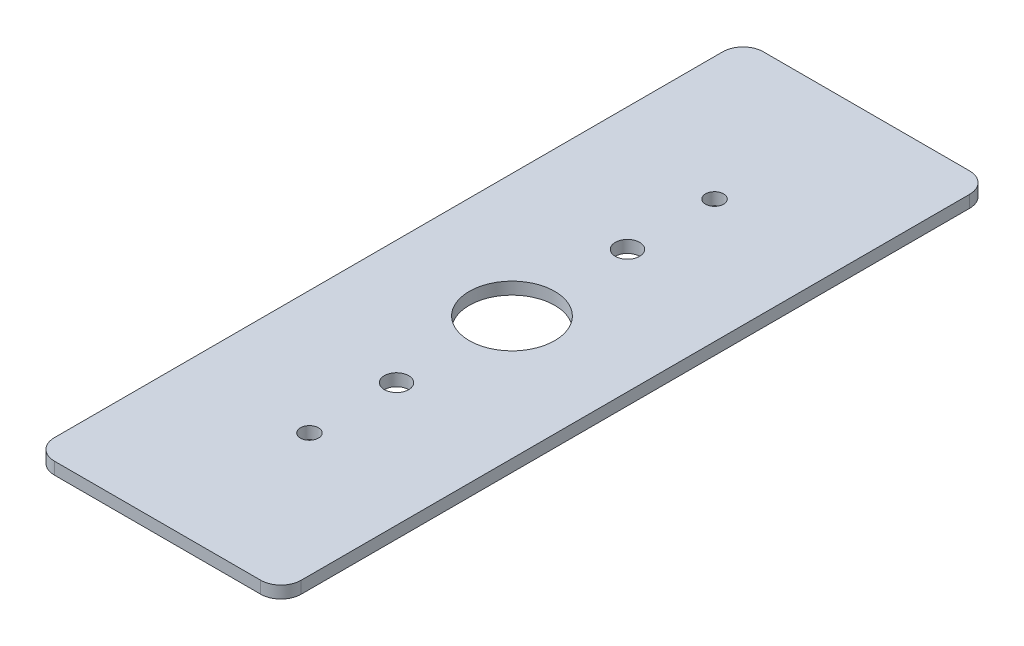
ISO-10303-21;
HEADER;
FILE_DESCRIPTION(('STEP AP214'),'2;1');
FILE_NAME('part.step','',(''),(''),'','','');
FILE_SCHEMA(('AUTOMOTIVE_DESIGN { 1 0 10303 214 1 1 1 1 }'));
ENDSEC;
DATA;
#1=APPLICATION_CONTEXT('core data for automotive mechanical design processes');
#2=APPLICATION_PROTOCOL_DEFINITION('international standard','automotive_design',2000,#1);
#3=PRODUCT_CONTEXT('',#1,'mechanical');
#4=PRODUCT('Part','Part','',(#3));
#5=PRODUCT_RELATED_PRODUCT_CATEGORY('part','',(#4));
#6=PRODUCT_DEFINITION_FORMATION('','',#4);
#7=PRODUCT_DEFINITION_CONTEXT('part definition',#1,'design');
#8=PRODUCT_DEFINITION('design','',#6,#7);
#9=PRODUCT_DEFINITION_SHAPE('','',#8);
#10=(LENGTH_UNIT() NAMED_UNIT(*) SI_UNIT(.MILLI.,.METRE.));
#11=(NAMED_UNIT(*) PLANE_ANGLE_UNIT() SI_UNIT($,.RADIAN.));
#12=(NAMED_UNIT(*) SI_UNIT($,.STERADIAN.) SOLID_ANGLE_UNIT());
#13=UNCERTAINTY_MEASURE_WITH_UNIT(LENGTH_MEASURE(1.E-05),#10,'distance_accuracy_value','');
#14=(GEOMETRIC_REPRESENTATION_CONTEXT(3) GLOBAL_UNCERTAINTY_ASSIGNED_CONTEXT((#13)) GLOBAL_UNIT_ASSIGNED_CONTEXT((#10,
#11,#12)) REPRESENTATION_CONTEXT('',''));
#15=CARTESIAN_POINT('',(0.,0.,0.));
#16=DIRECTION('',(0.,0.,1.));
#17=DIRECTION('',(1.,0.,0.));
#18=AXIS2_PLACEMENT_3D('',#15,#16,#17);
#19=CARTESIAN_POINT('',(-15.478125,1.524,-44.45));
#20=DIRECTION('',(0.,0.,1.));
#21=DIRECTION('',(1.,0.,0.));
#22=AXIS2_PLACEMENT_3D('',#19,#20,#21);
#23=PLANE('',#22);
#24=DIRECTION('',(-1.,0.,0.));
#25=VECTOR('',#24,1.);
#26=CARTESIAN_POINT('',(-15.478125,1.524,-44.45));
#27=LINE('',#26,#25);
#28=CARTESIAN_POINT('',(12.938125,1.524,-44.45));
#29=VERTEX_POINT('',#28);
#30=CARTESIAN_POINT('',(-12.938125,1.524,-44.45));
#31=VERTEX_POINT('',#30);
#32=EDGE_CURVE('E118',#29,#31,#27,.T.);
#33=ORIENTED_EDGE('',*,*,#32,.F.);
#34=DIRECTION('',(0.,-1.,0.));
#35=VECTOR('',#34,1.);
#36=CARTESIAN_POINT('',(12.938125,1.524,-44.45));
#37=LINE('',#36,#35);
#38=CARTESIAN_POINT('',(12.938125,0.,-44.45));
#39=VERTEX_POINT('',#38);
#40=EDGE_CURVE('E103',#29,#39,#37,.T.);
#41=ORIENTED_EDGE('',*,*,#40,.T.);
#42=DIRECTION('',(-1.,0.,0.));
#43=VECTOR('',#42,1.);
#44=CARTESIAN_POINT('',(-15.478125,0.,-44.45));
#45=LINE('',#44,#43);
#46=CARTESIAN_POINT('',(-12.938125,0.,-44.45));
#47=VERTEX_POINT('',#46);
#48=EDGE_CURVE('E115',#39,#47,#45,.T.);
#49=ORIENTED_EDGE('',*,*,#48,.T.);
#50=DIRECTION('',(0.,-1.,0.));
#51=VECTOR('',#50,1.);
#52=CARTESIAN_POINT('',(-12.938125,1.524,-44.45));
#53=LINE('',#52,#51);
#54=EDGE_CURVE('E120',#47,#31,#53,.F.);
#55=ORIENTED_EDGE('',*,*,#54,.T.);
#56=EDGE_LOOP('',(#33,#41,#49,#55));
#57=FACE_BOUND('',#56,.T.);
#58=ADVANCED_FACE('F34',(#57),#23,.F.);
#59=CARTESIAN_POINT('',(-15.478125,1.524,44.45));
#60=DIRECTION('',(1.,0.,0.));
#61=DIRECTION('',(0.,0.,-1.));
#62=AXIS2_PLACEMENT_3D('',#59,#60,#61);
#63=PLANE('',#62);
#64=DIRECTION('',(0.,0.,1.));
#65=VECTOR('',#64,1.);
#66=CARTESIAN_POINT('',(-15.478125,1.524,44.45));
#67=LINE('',#66,#65);
#68=CARTESIAN_POINT('',(-15.478125,1.524,-41.91));
#69=VERTEX_POINT('',#68);
#70=CARTESIAN_POINT('',(-15.478125,1.524,41.91));
#71=VERTEX_POINT('',#70);
#72=EDGE_CURVE('E173',#69,#71,#67,.T.);
#73=ORIENTED_EDGE('',*,*,#72,.F.);
#74=DIRECTION('',(0.,-1.,0.));
#75=VECTOR('',#74,1.);
#76=CARTESIAN_POINT('',(-15.478125,1.524,-41.91));
#77=LINE('',#76,#75);
#78=CARTESIAN_POINT('',(-15.478125,0.,-41.91));
#79=VERTEX_POINT('',#78);
#80=EDGE_CURVE('E157',#69,#79,#77,.T.);
#81=ORIENTED_EDGE('',*,*,#80,.T.);
#82=DIRECTION('',(0.,0.,1.));
#83=VECTOR('',#82,1.);
#84=CARTESIAN_POINT('',(-15.478125,0.,44.45));
#85=LINE('',#84,#83);
#86=CARTESIAN_POINT('',(-15.478125,0.,41.91));
#87=VERTEX_POINT('',#86);
#88=EDGE_CURVE('E124',#79,#87,#85,.T.);
#89=ORIENTED_EDGE('',*,*,#88,.T.);
#90=DIRECTION('',(0.,-1.,0.));
#91=VECTOR('',#90,1.);
#92=CARTESIAN_POINT('',(-15.478125,1.524,41.91));
#93=LINE('',#92,#91);
#94=EDGE_CURVE('E155',#87,#71,#93,.F.);
#95=ORIENTED_EDGE('',*,*,#94,.T.);
#96=EDGE_LOOP('',(#73,#81,#89,#95));
#97=FACE_BOUND('',#96,.T.);
#98=ADVANCED_FACE('F238',(#97),#63,.F.);
#99=CARTESIAN_POINT('',(-15.478125,1.524,44.45));
#100=DIRECTION('',(0.,0.,-1.));
#101=DIRECTION('',(-1.,0.,0.));
#102=AXIS2_PLACEMENT_3D('',#99,#100,#101);
#103=PLANE('',#102);
#104=DIRECTION('',(1.,0.,0.));
#105=VECTOR('',#104,1.);
#106=CARTESIAN_POINT('',(-15.478125,0.,44.45));
#107=LINE('',#106,#105);
#108=CARTESIAN_POINT('',(-12.938125,0.,44.45));
#109=VERTEX_POINT('',#108);
#110=CARTESIAN_POINT('',(12.938125,0.,44.45));
#111=VERTEX_POINT('',#110);
#112=EDGE_CURVE('E128',#109,#111,#107,.T.);
#113=ORIENTED_EDGE('',*,*,#112,.T.);
#114=DIRECTION('',(0.,-1.,0.));
#115=VECTOR('',#114,1.);
#116=CARTESIAN_POINT('',(12.938125,1.524,44.45));
#117=LINE('',#116,#115);
#118=CARTESIAN_POINT('',(12.938125,1.524,44.45));
#119=VERTEX_POINT('',#118);
#120=EDGE_CURVE('E11',#111,#119,#117,.F.);
#121=ORIENTED_EDGE('',*,*,#120,.T.);
#122=DIRECTION('',(1.,0.,0.));
#123=VECTOR('',#122,1.);
#124=CARTESIAN_POINT('',(-15.478125,1.524,44.45));
#125=LINE('',#124,#123);
#126=CARTESIAN_POINT('',(-12.938125,1.524,44.45));
#127=VERTEX_POINT('',#126);
#128=EDGE_CURVE('E163',#127,#119,#125,.T.);
#129=ORIENTED_EDGE('',*,*,#128,.F.);
#130=DIRECTION('',(0.,-1.,0.));
#131=VECTOR('',#130,1.);
#132=CARTESIAN_POINT('',(-12.938125,1.524,44.45));
#133=LINE('',#132,#131);
#134=EDGE_CURVE('E42',#127,#109,#133,.T.);
#135=ORIENTED_EDGE('',*,*,#134,.T.);
#136=EDGE_LOOP('',(#113,#121,#129,#135));
#137=FACE_BOUND('',#136,.T.);
#138=ADVANCED_FACE('F162',(#137),#103,.F.);
#139=CARTESIAN_POINT('',(15.478125,1.524,-44.45));
#140=DIRECTION('',(-1.,0.,0.));
#141=DIRECTION('',(0.,0.,1.));
#142=AXIS2_PLACEMENT_3D('',#139,#140,#141);
#143=PLANE('',#142);
#144=DIRECTION('',(0.,0.,-1.));
#145=VECTOR('',#144,1.);
#146=CARTESIAN_POINT('',(15.478125,0.,-44.45));
#147=LINE('',#146,#145);
#148=CARTESIAN_POINT('',(15.478125,0.,41.91));
#149=VERTEX_POINT('',#148);
#150=CARTESIAN_POINT('',(15.478125,0.,-41.91));
#151=VERTEX_POINT('',#150);
#152=EDGE_CURVE('E138',#149,#151,#147,.T.);
#153=ORIENTED_EDGE('',*,*,#152,.T.);
#154=DIRECTION('',(0.,-1.,0.));
#155=VECTOR('',#154,1.);
#156=CARTESIAN_POINT('',(15.478125,1.524,-41.91));
#157=LINE('',#156,#155);
#158=CARTESIAN_POINT('',(15.478125,1.524,-41.91));
#159=VERTEX_POINT('',#158);
#160=EDGE_CURVE('E104',#151,#159,#157,.F.);
#161=ORIENTED_EDGE('',*,*,#160,.T.);
#162=DIRECTION('',(0.,0.,-1.));
#163=VECTOR('',#162,1.);
#164=CARTESIAN_POINT('',(15.478125,1.524,-44.45));
#165=LINE('',#164,#163);
#166=CARTESIAN_POINT('',(15.478125,1.524,41.91));
#167=VERTEX_POINT('',#166);
#168=EDGE_CURVE('E134',#167,#159,#165,.T.);
#169=ORIENTED_EDGE('',*,*,#168,.F.);
#170=DIRECTION('',(0.,-1.,0.));
#171=VECTOR('',#170,1.);
#172=CARTESIAN_POINT('',(15.478125,1.524,41.91));
#173=LINE('',#172,#171);
#174=EDGE_CURVE('E109',#167,#149,#173,.T.);
#175=ORIENTED_EDGE('',*,*,#174,.T.);
#176=EDGE_LOOP('',(#153,#161,#169,#175));
#177=FACE_BOUND('',#176,.T.);
#178=ADVANCED_FACE('F171',(#177),#143,.F.);
#179=CARTESIAN_POINT('',(15.478125,1.524,-44.45));
#180=DIRECTION('',(0.,-1.,0.));
#181=DIRECTION('',(0.,0.,-1.));
#182=AXIS2_PLACEMENT_3D('',#179,#180,#181);
#183=PLANE('',#182);
#184=CARTESIAN_POINT('',(0.,1.524,0.));
#185=DIRECTION('',(0.,1.,0.));
#186=DIRECTION('',(0.,0.,1.));
#187=AXIS2_PLACEMENT_3D('',#184,#185,#186);
#188=CIRCLE('',#187,5.35812999999999);
#189=CARTESIAN_POINT('',(0.,1.524,5.35812999999999));
#190=VERTEX_POINT('',#189);
#191=EDGE_CURVE('E200',#190,#190,#188,.T.);
#192=ORIENTED_EDGE('',*,*,#191,.F.);
#193=EDGE_LOOP('',(#192));
#194=FACE_BOUND('',#193,.T.);
#195=CARTESIAN_POINT('',(0.,1.524,25.4));
#196=DIRECTION('',(0.,1.,0.));
#197=DIRECTION('',(0.,0.,1.));
#198=AXIS2_PLACEMENT_3D('',#195,#196,#197);
#199=CIRCLE('',#198,1.1303);
#200=CARTESIAN_POINT('',(0.,1.524,26.5303));
#201=VERTEX_POINT('',#200);
#202=EDGE_CURVE('E194',#201,#201,#199,.T.);
#203=ORIENTED_EDGE('',*,*,#202,.F.);
#204=EDGE_LOOP('',(#203));
#205=FACE_BOUND('',#204,.T.);
#206=CARTESIAN_POINT('',(0.,1.524,-25.4));
#207=DIRECTION('',(0.,1.,0.));
#208=DIRECTION('',(0.,0.,1.));
#209=AXIS2_PLACEMENT_3D('',#206,#207,#208);
#210=CIRCLE('',#209,1.1303);
#211=CARTESIAN_POINT('',(0.,1.524,-24.2697));
#212=VERTEX_POINT('',#211);
#213=EDGE_CURVE('E188',#212,#212,#210,.T.);
#214=ORIENTED_EDGE('',*,*,#213,.F.);
#215=EDGE_LOOP('',(#214));
#216=FACE_BOUND('',#215,.T.);
#217=CARTESIAN_POINT('',(0.,1.524,-14.478));
#218=DIRECTION('',(0.,-1.,0.));
#219=DIRECTION('',(0.,0.,1.));
#220=AXIS2_PLACEMENT_3D('',#217,#218,#219);
#221=CIRCLE('',#220,1.524);
#222=CARTESIAN_POINT('',(0.,1.524,-12.954));
#223=VERTEX_POINT('',#222);
#224=EDGE_CURVE('E178',#223,#223,#221,.T.);
#225=ORIENTED_EDGE('',*,*,#224,.T.);
#226=EDGE_LOOP('',(#225));
#227=FACE_BOUND('',#226,.T.);
#228=CARTESIAN_POINT('',(0.,1.524,14.478));
#229=DIRECTION('',(0.,-1.,0.));
#230=DIRECTION('',(0.,0.,-1.));
#231=AXIS2_PLACEMENT_3D('',#228,#229,#230);
#232=CIRCLE('',#231,1.524);
#233=CARTESIAN_POINT('',(0.,1.524,12.954));
#234=VERTEX_POINT('',#233);
#235=EDGE_CURVE('E125',#234,#234,#232,.T.);
#236=ORIENTED_EDGE('',*,*,#235,.T.);
#237=EDGE_LOOP('',(#236));
#238=FACE_BOUND('',#237,.T.);
#239=ORIENTED_EDGE('',*,*,#168,.T.);
#240=CARTESIAN_POINT('',(12.938125,1.524,-41.91));
#241=DIRECTION('',(0.,-1.,0.));
#242=DIRECTION('',(0.,0.,-1.));
#243=AXIS2_PLACEMENT_3D('',#240,#241,#242);
#244=CIRCLE('',#243,2.54);
#245=EDGE_CURVE('E153',#159,#29,#244,.F.);
#246=ORIENTED_EDGE('',*,*,#245,.T.);
#247=ORIENTED_EDGE('',*,*,#32,.T.);
#248=CARTESIAN_POINT('',(-12.938125,1.524,-41.91));
#249=DIRECTION('',(0.,-1.,0.));
#250=DIRECTION('',(0.,0.,-1.));
#251=AXIS2_PLACEMENT_3D('',#248,#249,#250);
#252=CIRCLE('',#251,2.54);
#253=EDGE_CURVE('E151',#31,#69,#252,.F.);
#254=ORIENTED_EDGE('',*,*,#253,.T.);
#255=ORIENTED_EDGE('',*,*,#72,.T.);
#256=CARTESIAN_POINT('',(-12.938125,1.524,41.91));
#257=DIRECTION('',(0.,-1.,0.));
#258=DIRECTION('',(0.,0.,-1.));
#259=AXIS2_PLACEMENT_3D('',#256,#257,#258);
#260=CIRCLE('',#259,2.54);
#261=EDGE_CURVE('E54',#71,#127,#260,.F.);
#262=ORIENTED_EDGE('',*,*,#261,.T.);
#263=ORIENTED_EDGE('',*,*,#128,.T.);
#264=CARTESIAN_POINT('',(12.938125,1.524,41.91));
#265=DIRECTION('',(0.,-1.,0.));
#266=DIRECTION('',(0.,0.,-1.));
#267=AXIS2_PLACEMENT_3D('',#264,#265,#266);
#268=CIRCLE('',#267,2.54);
#269=EDGE_CURVE('E149',#119,#167,#268,.F.);
#270=ORIENTED_EDGE('',*,*,#269,.T.);
#271=EDGE_LOOP('',(#239,#246,#247,#254,#255,#262,#263,#270));
#272=FACE_BOUND('',#271,.T.);
#273=ADVANCED_FACE('F206',(#194,#205,#216,#227,#238,#272),#183,.F.);
#274=CARTESIAN_POINT('',(15.478125,0.,-44.45));
#275=DIRECTION('',(0.,-1.,0.));
#276=DIRECTION('',(0.,0.,-1.));
#277=AXIS2_PLACEMENT_3D('',#274,#275,#276);
#278=PLANE('',#277);
#279=CARTESIAN_POINT('',(0.,0.,0.));
#280=DIRECTION('',(0.,1.,0.));
#281=DIRECTION('',(0.,0.,1.));
#282=AXIS2_PLACEMENT_3D('',#279,#280,#281);
#283=CIRCLE('',#282,5.35813);
#284=CARTESIAN_POINT('',(0.,0.,5.35813));
#285=VERTEX_POINT('',#284);
#286=EDGE_CURVE('E197',#285,#285,#283,.T.);
#287=ORIENTED_EDGE('',*,*,#286,.T.);
#288=EDGE_LOOP('',(#287));
#289=FACE_BOUND('',#288,.T.);
#290=CARTESIAN_POINT('',(0.,0.,25.4));
#291=DIRECTION('',(0.,1.,0.));
#292=DIRECTION('',(0.,0.,1.));
#293=AXIS2_PLACEMENT_3D('',#290,#291,#292);
#294=CIRCLE('',#293,1.1303);
#295=CARTESIAN_POINT('',(0.,0.,26.5303));
#296=VERTEX_POINT('',#295);
#297=EDGE_CURVE('E191',#296,#296,#294,.T.);
#298=ORIENTED_EDGE('',*,*,#297,.T.);
#299=EDGE_LOOP('',(#298));
#300=FACE_BOUND('',#299,.T.);
#301=CARTESIAN_POINT('',(0.,0.,-25.4));
#302=DIRECTION('',(0.,1.,0.));
#303=DIRECTION('',(0.,0.,1.));
#304=AXIS2_PLACEMENT_3D('',#301,#302,#303);
#305=CIRCLE('',#304,1.1303);
#306=CARTESIAN_POINT('',(0.,0.,-24.2697));
#307=VERTEX_POINT('',#306);
#308=EDGE_CURVE('E183',#307,#307,#305,.T.);
#309=ORIENTED_EDGE('',*,*,#308,.T.);
#310=EDGE_LOOP('',(#309));
#311=FACE_BOUND('',#310,.T.);
#312=CARTESIAN_POINT('',(0.,0.,-14.478));
#313=DIRECTION('',(0.,-1.,0.));
#314=DIRECTION('',(0.,0.,1.));
#315=AXIS2_PLACEMENT_3D('',#312,#313,#314);
#316=CIRCLE('',#315,1.524);
#317=CARTESIAN_POINT('',(0.,0.,-12.954));
#318=VERTEX_POINT('',#317);
#319=EDGE_CURVE('E180',#318,#318,#316,.T.);
#320=ORIENTED_EDGE('',*,*,#319,.F.);
#321=EDGE_LOOP('',(#320));
#322=FACE_BOUND('',#321,.T.);
#323=CARTESIAN_POINT('',(0.,0.,14.478));
#324=DIRECTION('',(0.,-1.,0.));
#325=DIRECTION('',(0.,0.,-1.));
#326=AXIS2_PLACEMENT_3D('',#323,#324,#325);
#327=CIRCLE('',#326,1.524);
#328=CARTESIAN_POINT('',(0.,0.,12.954));
#329=VERTEX_POINT('',#328);
#330=EDGE_CURVE('E131',#329,#329,#327,.T.);
#331=ORIENTED_EDGE('',*,*,#330,.F.);
#332=EDGE_LOOP('',(#331));
#333=FACE_BOUND('',#332,.T.);
#334=ORIENTED_EDGE('',*,*,#48,.F.);
#335=CARTESIAN_POINT('',(12.938125,0.,-41.91));
#336=DIRECTION('',(0.,-1.,0.));
#337=DIRECTION('',(0.,0.,-1.));
#338=AXIS2_PLACEMENT_3D('',#335,#336,#337);
#339=CIRCLE('',#338,2.54);
#340=EDGE_CURVE('E99',#39,#151,#339,.T.);
#341=ORIENTED_EDGE('',*,*,#340,.T.);
#342=ORIENTED_EDGE('',*,*,#152,.F.);
#343=CARTESIAN_POINT('',(12.938125,0.,41.91));
#344=DIRECTION('',(0.,-1.,0.));
#345=DIRECTION('',(0.,0.,-1.));
#346=AXIS2_PLACEMENT_3D('',#343,#344,#345);
#347=CIRCLE('',#346,2.54);
#348=EDGE_CURVE('E142',#149,#111,#347,.T.);
#349=ORIENTED_EDGE('',*,*,#348,.T.);
#350=ORIENTED_EDGE('',*,*,#112,.F.);
#351=CARTESIAN_POINT('',(-12.938125,0.,41.91));
#352=DIRECTION('',(0.,-1.,0.));
#353=DIRECTION('',(0.,0.,-1.));
#354=AXIS2_PLACEMENT_3D('',#351,#352,#353);
#355=CIRCLE('',#354,2.54);
#356=EDGE_CURVE('E119',#109,#87,#355,.T.);
#357=ORIENTED_EDGE('',*,*,#356,.T.);
#358=ORIENTED_EDGE('',*,*,#88,.F.);
#359=CARTESIAN_POINT('',(-12.938125,0.,-41.91));
#360=DIRECTION('',(0.,-1.,0.));
#361=DIRECTION('',(0.,0.,-1.));
#362=AXIS2_PLACEMENT_3D('',#359,#360,#361);
#363=CIRCLE('',#362,2.54);
#364=EDGE_CURVE('E110',#79,#47,#363,.T.);
#365=ORIENTED_EDGE('',*,*,#364,.T.);
#366=EDGE_LOOP('',(#334,#341,#342,#349,#350,#357,#358,#365));
#367=FACE_BOUND('',#366,.T.);
#368=ADVANCED_FACE('F122',(#289,#300,#311,#322,#333,#367),#278,.T.);
#369=CARTESIAN_POINT('',(12.938125,1.524,-41.91));
#370=DIRECTION('',(0.,-1.,0.));
#371=DIRECTION('',(0.,0.,-1.));
#372=AXIS2_PLACEMENT_3D('',#369,#370,#371);
#373=CYLINDRICAL_SURFACE('',#372,2.54);
#374=ORIENTED_EDGE('',*,*,#245,.F.);
#375=ORIENTED_EDGE('',*,*,#160,.F.);
#376=ORIENTED_EDGE('',*,*,#340,.F.);
#377=ORIENTED_EDGE('',*,*,#40,.F.);
#378=EDGE_LOOP('',(#374,#375,#376,#377));
#379=FACE_BOUND('',#378,.T.);
#380=ADVANCED_FACE('F102',(#379),#373,.T.);
#381=CARTESIAN_POINT('',(-12.938125,1.524,-41.91));
#382=DIRECTION('',(0.,-1.,0.));
#383=DIRECTION('',(0.,0.,-1.));
#384=AXIS2_PLACEMENT_3D('',#381,#382,#383);
#385=CYLINDRICAL_SURFACE('',#384,2.54);
#386=ORIENTED_EDGE('',*,*,#253,.F.);
#387=ORIENTED_EDGE('',*,*,#54,.F.);
#388=ORIENTED_EDGE('',*,*,#364,.F.);
#389=ORIENTED_EDGE('',*,*,#80,.F.);
#390=EDGE_LOOP('',(#386,#387,#388,#389));
#391=FACE_BOUND('',#390,.T.);
#392=ADVANCED_FACE('F233',(#391),#385,.T.);
#393=CARTESIAN_POINT('',(12.938125,1.524,41.91));
#394=DIRECTION('',(0.,-1.,0.));
#395=DIRECTION('',(0.,0.,-1.));
#396=AXIS2_PLACEMENT_3D('',#393,#394,#395);
#397=CYLINDRICAL_SURFACE('',#396,2.54);
#398=ORIENTED_EDGE('',*,*,#269,.F.);
#399=ORIENTED_EDGE('',*,*,#120,.F.);
#400=ORIENTED_EDGE('',*,*,#348,.F.);
#401=ORIENTED_EDGE('',*,*,#174,.F.);
#402=EDGE_LOOP('',(#398,#399,#400,#401));
#403=FACE_BOUND('',#402,.T.);
#404=ADVANCED_FACE('F168',(#403),#397,.T.);
#405=CARTESIAN_POINT('',(-12.938125,1.524,41.91));
#406=DIRECTION('',(0.,-1.,0.));
#407=DIRECTION('',(0.,0.,-1.));
#408=AXIS2_PLACEMENT_3D('',#405,#406,#407);
#409=CYLINDRICAL_SURFACE('',#408,2.54);
#410=ORIENTED_EDGE('',*,*,#261,.F.);
#411=ORIENTED_EDGE('',*,*,#94,.F.);
#412=ORIENTED_EDGE('',*,*,#356,.F.);
#413=ORIENTED_EDGE('',*,*,#134,.F.);
#414=EDGE_LOOP('',(#410,#411,#412,#413));
#415=FACE_BOUND('',#414,.T.);
#416=ADVANCED_FACE('F36',(#415),#409,.T.);
#417=CARTESIAN_POINT('',(0.,1.524,14.478));
#418=DIRECTION('',(0.,-1.,0.));
#419=DIRECTION('',(0.,0.,-1.));
#420=AXIS2_PLACEMENT_3D('',#417,#418,#419);
#421=CYLINDRICAL_SURFACE('',#420,1.524);
#422=ORIENTED_EDGE('',*,*,#235,.F.);
#423=EDGE_LOOP('',(#422));
#424=FACE_BOUND('',#423,.T.);
#425=ORIENTED_EDGE('',*,*,#330,.T.);
#426=EDGE_LOOP('',(#425));
#427=FACE_BOUND('',#426,.T.);
#428=ADVANCED_FACE('F218',(#424,#427),#421,.F.);
#429=CARTESIAN_POINT('',(0.,1.524,-14.478));
#430=DIRECTION('',(0.,-1.,0.));
#431=DIRECTION('',(0.,0.,-1.));
#432=AXIS2_PLACEMENT_3D('',#429,#430,#431);
#433=CYLINDRICAL_SURFACE('',#432,1.524);
#434=ORIENTED_EDGE('',*,*,#224,.F.);
#435=EDGE_LOOP('',(#434));
#436=FACE_BOUND('',#435,.T.);
#437=ORIENTED_EDGE('',*,*,#319,.T.);
#438=EDGE_LOOP('',(#437));
#439=FACE_BOUND('',#438,.T.);
#440=ADVANCED_FACE('F221',(#436,#439),#433,.F.);
#441=CARTESIAN_POINT('',(0.,1.524,-25.4));
#442=DIRECTION('',(0.,1.,0.));
#443=DIRECTION('',(0.,0.,1.));
#444=AXIS2_PLACEMENT_3D('',#441,#442,#443);
#445=CYLINDRICAL_SURFACE('',#444,1.1303);
#446=ORIENTED_EDGE('',*,*,#308,.F.);
#447=EDGE_LOOP('',(#446));
#448=FACE_BOUND('',#447,.T.);
#449=ORIENTED_EDGE('',*,*,#213,.T.);
#450=EDGE_LOOP('',(#449));
#451=FACE_BOUND('',#450,.T.);
#452=ADVANCED_FACE('F269',(#448,#451),#445,.F.);
#453=CARTESIAN_POINT('',(0.,1.524,25.4));
#454=DIRECTION('',(0.,1.,0.));
#455=DIRECTION('',(0.,0.,1.));
#456=AXIS2_PLACEMENT_3D('',#453,#454,#455);
#457=CYLINDRICAL_SURFACE('',#456,1.1303);
#458=ORIENTED_EDGE('',*,*,#297,.F.);
#459=EDGE_LOOP('',(#458));
#460=FACE_BOUND('',#459,.T.);
#461=ORIENTED_EDGE('',*,*,#202,.T.);
#462=EDGE_LOOP('',(#461));
#463=FACE_BOUND('',#462,.T.);
#464=ADVANCED_FACE('F278',(#460,#463),#457,.F.);
#465=CARTESIAN_POINT('',(0.,1.524,0.));
#466=DIRECTION('',(0.,1.,0.));
#467=DIRECTION('',(0.,0.,1.));
#468=AXIS2_PLACEMENT_3D('',#465,#466,#467);
#469=CYLINDRICAL_SURFACE('',#468,5.35812999999999);
#470=ORIENTED_EDGE('',*,*,#286,.F.);
#471=EDGE_LOOP('',(#470));
#472=FACE_BOUND('',#471,.T.);
#473=ORIENTED_EDGE('',*,*,#191,.T.);
#474=EDGE_LOOP('',(#473));
#475=FACE_BOUND('',#474,.T.);
#476=ADVANCED_FACE('F204',(#472,#475),#469,.F.);
#477=CLOSED_SHELL('',(#58,#98,#138,#178,#273,#368,#380,#392,#404,#416,#428,#440,#452,#464,#476));
#478=MANIFOLD_SOLID_BREP('B2',#477);
#479=ADVANCED_BREP_SHAPE_REPRESENTATION('',(#18,#478),#14);
#480=SHAPE_DEFINITION_REPRESENTATION(#9,#479);
ENDSEC;
END-ISO-10303-21;
